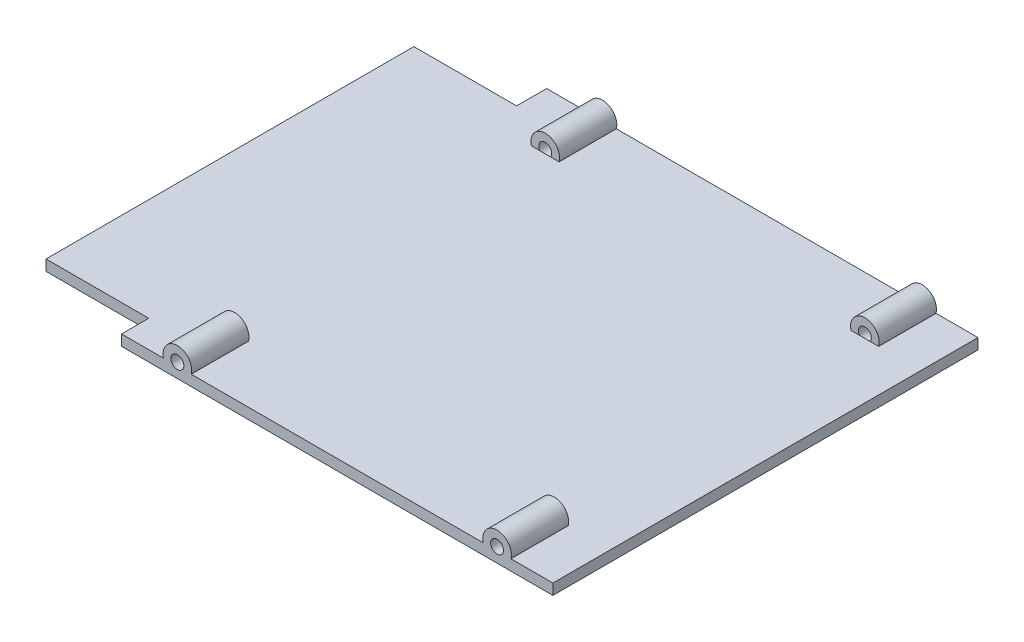
ISO-10303-21;
HEADER;
FILE_DESCRIPTION(('STEP AP214'),'2;1');
FILE_NAME('part.step','',(''),(''),'','','');
FILE_SCHEMA(('AUTOMOTIVE_DESIGN { 1 0 10303 214 1 1 1 1 }'));
ENDSEC;
DATA;
#1=APPLICATION_CONTEXT('core data for automotive mechanical design processes');
#2=APPLICATION_PROTOCOL_DEFINITION('international standard','automotive_design',2000,#1);
#3=PRODUCT_CONTEXT('',#1,'mechanical');
#4=PRODUCT('Part','Part','',(#3));
#5=PRODUCT_RELATED_PRODUCT_CATEGORY('part','',(#4));
#6=PRODUCT_DEFINITION_FORMATION('','',#4);
#7=PRODUCT_DEFINITION_CONTEXT('part definition',#1,'design');
#8=PRODUCT_DEFINITION('design','',#6,#7);
#9=PRODUCT_DEFINITION_SHAPE('','',#8);
#10=(LENGTH_UNIT() NAMED_UNIT(*) SI_UNIT(.MILLI.,.METRE.));
#11=(NAMED_UNIT(*) PLANE_ANGLE_UNIT() SI_UNIT($,.RADIAN.));
#12=(NAMED_UNIT(*) SI_UNIT($,.STERADIAN.) SOLID_ANGLE_UNIT());
#13=UNCERTAINTY_MEASURE_WITH_UNIT(LENGTH_MEASURE(1.E-05),#10,'distance_accuracy_value','');
#14=(GEOMETRIC_REPRESENTATION_CONTEXT(3) GLOBAL_UNCERTAINTY_ASSIGNED_CONTEXT((#13)) GLOBAL_UNIT_ASSIGNED_CONTEXT((#10,
#11,#12)) REPRESENTATION_CONTEXT('',''));
#15=CARTESIAN_POINT('',(0.,0.,0.));
#16=DIRECTION('',(0.,0.,1.));
#17=DIRECTION('',(1.,0.,0.));
#18=AXIS2_PLACEMENT_3D('',#15,#16,#17);
#19=CARTESIAN_POINT('',(-536.173043629544,-6.26719487503217,-135.104672809914));
#20=DIRECTION('',(1.,0.,0.));
#21=DIRECTION('',(0.,0.,-1.));
#22=AXIS2_PLACEMENT_3D('',#19,#20,#21);
#23=PLANE('',#22);
#24=DIRECTION('',(0.,1.,0.));
#25=VECTOR('',#24,1.);
#26=CARTESIAN_POINT('',(-536.173043629546,-26.2671948750322,-19.2560035032262));
#27=LINE('',#26,#25);
#28=CARTESIAN_POINT('',(-536.173043629544,-26.2671948750323,-19.2560035032263));
#29=VERTEX_POINT('',#28);
#30=CARTESIAN_POINT('',(-536.173043629544,-24.7671948750323,-19.2560035032263));
#31=VERTEX_POINT('',#30);
#32=EDGE_CURVE('E467',#29,#31,#27,.T.);
#33=ORIENTED_EDGE('',*,*,#32,.F.);
#34=DIRECTION('',(0.,0.,1.));
#35=VECTOR('',#34,1.);
#36=CARTESIAN_POINT('',(-536.173043629544,-26.2671948750323,-135.104672809914));
#37=LINE('',#36,#35);
#38=CARTESIAN_POINT('',(-536.173043629544,-26.2671948750323,-15.4560035032414));
#39=VERTEX_POINT('',#38);
#40=EDGE_CURVE('E381',#29,#39,#37,.T.);
#41=ORIENTED_EDGE('',*,*,#40,.T.);
#42=DIRECTION('',(0.,1.,0.));
#43=VECTOR('',#42,1.);
#44=CARTESIAN_POINT('',(-536.173043629544,-6.26719487503217,-15.4560035032414));
#45=LINE('',#44,#43);
#46=CARTESIAN_POINT('',(-536.173043629544,-24.7671948750323,-15.4560035032414));
#47=VERTEX_POINT('',#46);
#48=EDGE_CURVE('E370',#39,#47,#45,.T.);
#49=ORIENTED_EDGE('',*,*,#48,.T.);
#50=DIRECTION('',(0.,0.,1.));
#51=VECTOR('',#50,1.);
#52=CARTESIAN_POINT('',(-536.173043629544,-24.7671948750323,-135.104672809914));
#53=LINE('',#52,#51);
#54=EDGE_CURVE('E411',#31,#47,#53,.T.);
#55=ORIENTED_EDGE('',*,*,#54,.F.);
#56=EDGE_LOOP('',(#33,#41,#49,#55));
#57=FACE_BOUND('',#56,.T.);
#58=ADVANCED_FACE('F40',(#57),#23,.F.);
#59=DIRECTION('',(0.,-1.,0.));
#60=VECTOR('',#59,1.);
#61=CARTESIAN_POINT('',(-536.173043629546,-24.7671948750323,-70.6360035032162));
#62=LINE('',#61,#60);
#63=CARTESIAN_POINT('',(-536.173043629544,-24.7671948750323,-70.6360035032162));
#64=VERTEX_POINT('',#63);
#65=CARTESIAN_POINT('',(-536.173043629546,-26.2671948750323,-70.6360035032162));
#66=VERTEX_POINT('',#65);
#67=EDGE_CURVE('E453',#64,#66,#62,.T.);
#68=ORIENTED_EDGE('',*,*,#67,.F.);
#69=CARTESIAN_POINT('',(-536.173043629544,-24.7671948750323,-74.8360035032172));
#70=VERTEX_POINT('',#69);
#71=EDGE_CURVE('E408',#70,#64,#53,.T.);
#72=ORIENTED_EDGE('',*,*,#71,.F.);
#73=DIRECTION('',(0.,1.,0.));
#74=VECTOR('',#73,1.);
#75=CARTESIAN_POINT('',(-536.173043629544,-6.26719487503217,-74.8360035032172));
#76=LINE('',#75,#74);
#77=CARTESIAN_POINT('',(-536.173043629544,-26.2671948750323,-74.8360035032172));
#78=VERTEX_POINT('',#77);
#79=EDGE_CURVE('E375',#78,#70,#76,.T.);
#80=ORIENTED_EDGE('',*,*,#79,.F.);
#81=EDGE_CURVE('E376',#78,#66,#37,.T.);
#82=ORIENTED_EDGE('',*,*,#81,.T.);
#83=EDGE_LOOP('',(#68,#72,#80,#82));
#84=FACE_BOUND('',#83,.T.);
#85=ADVANCED_FACE('F264',(#84),#23,.F.);
#86=CARTESIAN_POINT('',(-360.373043629546,-24.7671948750323,-135.104672809914));
#87=DIRECTION('',(0.,-1.,0.));
#88=DIRECTION('',(0.,0.,-1.));
#89=AXIS2_PLACEMENT_3D('',#86,#87,#88);
#90=PLANE('',#89);
#91=DIRECTION('',(-1.,0.,0.));
#92=VECTOR('',#91,1.);
#93=CARTESIAN_POINT('',(-360.373043629546,-24.7671948750323,-23.4560035032414));
#94=LINE('',#93,#92);
#95=CARTESIAN_POINT('',(-526.43655195634,-24.7671948750323,-23.4560035032414));
#96=VERTEX_POINT('',#95);
#97=CARTESIAN_POINT('',(-527.624712152125,-24.7671948750322,-23.4560035032414));
#98=VERTEX_POINT('',#97);
#99=EDGE_CURVE('E190',#96,#98,#94,.T.);
#100=ORIENTED_EDGE('',*,*,#99,.F.);
#101=DIRECTION('',(0.,0.,1.));
#102=VECTOR('',#101,1.);
#103=CARTESIAN_POINT('',(-526.43655195634,-24.7671948750323,-23.4560035032414));
#104=LINE('',#103,#102);
#105=CARTESIAN_POINT('',(-526.43655195634,-24.7671948750322,-15.4560035032414));
#106=VERTEX_POINT('',#105);
#107=EDGE_CURVE('E212',#96,#106,#104,.T.);
#108=ORIENTED_EDGE('',*,*,#107,.T.);
#109=DIRECTION('',(1.,0.,0.));
#110=VECTOR('',#109,1.);
#111=CARTESIAN_POINT('',(-360.373043629546,-24.7671948750323,-15.4560035032414));
#112=LINE('',#111,#110);
#113=CARTESIAN_POINT('',(-485.659535302359,-24.7671948750323,-15.4560035032414));
#114=VERTEX_POINT('',#113);
#115=EDGE_CURVE('E244',#106,#114,#112,.T.);
#116=ORIENTED_EDGE('',*,*,#115,.T.);
#117=DIRECTION('',(0.,0.,1.));
#118=VECTOR('',#117,1.);
#119=CARTESIAN_POINT('',(-485.659535302359,-24.7671948750323,-23.4560035032414));
#120=LINE('',#119,#118);
#121=CARTESIAN_POINT('',(-485.659535302359,-24.7671948750323,-23.4560035032414));
#122=VERTEX_POINT('',#121);
#123=EDGE_CURVE('E222',#114,#122,#120,.F.);
#124=ORIENTED_EDGE('',*,*,#123,.T.);
#125=DIRECTION('',(-1.,0.,0.));
#126=VECTOR('',#125,1.);
#127=CARTESIAN_POINT('',(-360.373043629546,-24.7671948750323,-23.4560035032414));
#128=LINE('',#127,#126);
#129=CARTESIAN_POINT('',(-484.471375106822,-24.7671948750323,-23.4560035032414));
#130=VERTEX_POINT('',#129);
#131=EDGE_CURVE('E208',#130,#122,#128,.T.);
#132=ORIENTED_EDGE('',*,*,#131,.F.);
#133=CARTESIAN_POINT('',(-482.974712152109,-24.7671948750323,-23.4560035032414));
#134=VERTEX_POINT('',#133);
#135=EDGE_CURVE('E207',#134,#130,#128,.T.);
#136=ORIENTED_EDGE('',*,*,#135,.F.);
#137=CARTESIAN_POINT('',(-481.786551956575,-24.7671948750323,-23.4560035032414));
#138=VERTEX_POINT('',#137);
#139=EDGE_CURVE('E205',#138,#134,#128,.T.);
#140=ORIENTED_EDGE('',*,*,#139,.F.);
#141=DIRECTION('',(0.,0.,1.));
#142=VECTOR('',#141,1.);
#143=CARTESIAN_POINT('',(-481.786551956575,-24.7671948750323,-23.4560035032414));
#144=LINE('',#143,#142);
#145=CARTESIAN_POINT('',(-481.786551956575,-24.7671948750323,-15.4560035032414));
#146=VERTEX_POINT('',#145);
#147=EDGE_CURVE('E217',#138,#146,#144,.T.);
#148=ORIENTED_EDGE('',*,*,#147,.T.);
#149=CARTESIAN_POINT('',(-475.923043629544,-24.7671948750323,-15.4560035032414));
#150=VERTEX_POINT('',#149);
#151=EDGE_CURVE('E394',#146,#150,#112,.T.);
#152=ORIENTED_EDGE('',*,*,#151,.T.);
#153=DIRECTION('',(0.,0.,1.));
#154=VECTOR('',#153,1.);
#155=CARTESIAN_POINT('',(-475.923043629544,-24.7671948750323,-135.104672809914));
#156=LINE('',#155,#154);
#157=CARTESIAN_POINT('',(-475.923043629544,-24.7671948750323,-74.8360035032172));
#158=VERTEX_POINT('',#157);
#159=EDGE_CURVE('E392',#158,#150,#156,.T.);
#160=ORIENTED_EDGE('',*,*,#159,.F.);
#161=DIRECTION('',(1.,0.,0.));
#162=VECTOR('',#161,1.);
#163=CARTESIAN_POINT('',(-360.373043629546,-24.7671948750323,-74.8360035032172));
#164=LINE('',#163,#162);
#165=CARTESIAN_POINT('',(-481.786551955716,-24.7671948750323,-74.8360035032172));
#166=VERTEX_POINT('',#165);
#167=EDGE_CURVE('E379',#166,#158,#164,.T.);
#168=ORIENTED_EDGE('',*,*,#167,.F.);
#169=DIRECTION('',(0.,0.,-1.));
#170=VECTOR('',#169,1.);
#171=CARTESIAN_POINT('',(-481.786551955716,-24.7671948750323,-66.8360035032172));
#172=LINE('',#171,#170);
#173=CARTESIAN_POINT('',(-481.786551955716,-24.7671948750323,-66.8360035032172));
#174=VERTEX_POINT('',#173);
#175=EDGE_CURVE('E430',#166,#174,#172,.F.);
#176=ORIENTED_EDGE('',*,*,#175,.T.);
#177=DIRECTION('',(1.,0.,0.));
#178=VECTOR('',#177,1.);
#179=CARTESIAN_POINT('',(-360.373043629546,-24.7671948750323,-66.8360035032172));
#180=LINE('',#179,#178);
#181=CARTESIAN_POINT('',(-482.974712152113,-24.7671948750323,-66.8360035032172));
#182=VERTEX_POINT('',#181);
#183=EDGE_CURVE('E420',#182,#174,#180,.T.);
#184=ORIENTED_EDGE('',*,*,#183,.F.);
#185=CARTESIAN_POINT('',(-484.471375106822,-24.7671948750323,-66.8360035032172));
#186=VERTEX_POINT('',#185);
#187=EDGE_CURVE('E427',#186,#182,#180,.T.);
#188=ORIENTED_EDGE('',*,*,#187,.F.);
#189=CARTESIAN_POINT('',(-485.659535303219,-24.7671948750323,-66.8360035032172));
#190=VERTEX_POINT('',#189);
#191=EDGE_CURVE('E423',#190,#186,#180,.T.);
#192=ORIENTED_EDGE('',*,*,#191,.F.);
#193=DIRECTION('',(0.,0.,-1.));
#194=VECTOR('',#193,1.);
#195=CARTESIAN_POINT('',(-485.659535303219,-24.7671948750323,-66.8360035032172));
#196=LINE('',#195,#194);
#197=CARTESIAN_POINT('',(-485.659535303219,-24.7671948750323,-74.8360035032172));
#198=VERTEX_POINT('',#197);
#199=EDGE_CURVE('E528',#190,#198,#196,.T.);
#200=ORIENTED_EDGE('',*,*,#199,.T.);
#201=CARTESIAN_POINT('',(-526.436551956938,-24.7671948750323,-74.8360035032172));
#202=VERTEX_POINT('',#201);
#203=EDGE_CURVE('E403',#202,#198,#164,.T.);
#204=ORIENTED_EDGE('',*,*,#203,.F.);
#205=DIRECTION('',(0.,0.,-1.));
#206=VECTOR('',#205,1.);
#207=CARTESIAN_POINT('',(-526.436551956938,-24.7671948750323,-66.8360035032172));
#208=LINE('',#207,#206);
#209=CARTESIAN_POINT('',(-526.436551956938,-24.7671948750323,-66.8360035032172));
#210=VERTEX_POINT('',#209);
#211=EDGE_CURVE('E434',#202,#210,#208,.F.);
#212=ORIENTED_EDGE('',*,*,#211,.T.);
#213=DIRECTION('',(1.,0.,0.));
#214=VECTOR('',#213,1.);
#215=CARTESIAN_POINT('',(-360.373043629546,-24.7671948750323,-66.8360035032172));
#216=LINE('',#215,#214);
#217=CARTESIAN_POINT('',(-527.624712152128,-24.7671948750323,-66.8360035032172));
#218=VERTEX_POINT('',#217);
#219=EDGE_CURVE('E437',#218,#210,#216,.T.);
#220=ORIENTED_EDGE('',*,*,#219,.F.);
#221=CARTESIAN_POINT('',(-529.121375106838,-24.7671948750323,-66.8360035032172));
#222=VERTEX_POINT('',#221);
#223=EDGE_CURVE('E438',#222,#218,#216,.T.);
#224=ORIENTED_EDGE('',*,*,#223,.F.);
#225=CARTESIAN_POINT('',(-530.309535302028,-24.7671948750323,-66.8360035032172));
#226=VERTEX_POINT('',#225);
#227=EDGE_CURVE('E439',#226,#222,#216,.T.);
#228=ORIENTED_EDGE('',*,*,#227,.F.);
#229=DIRECTION('',(0.,0.,-1.));
#230=VECTOR('',#229,1.);
#231=CARTESIAN_POINT('',(-530.309535302028,-24.7671948750323,-66.8360035032172));
#232=LINE('',#231,#230);
#233=CARTESIAN_POINT('',(-530.309535302028,-24.7671948750323,-74.8360035032172));
#234=VERTEX_POINT('',#233);
#235=EDGE_CURVE('E431',#226,#234,#232,.T.);
#236=ORIENTED_EDGE('',*,*,#235,.T.);
#237=EDGE_CURVE('E401',#70,#234,#164,.T.);
#238=ORIENTED_EDGE('',*,*,#237,.F.);
#239=ORIENTED_EDGE('',*,*,#71,.T.);
#240=DIRECTION('',(1.,0.,0.));
#241=VECTOR('',#240,1.);
#242=CARTESIAN_POINT('',(-602.124934645333,-24.7671948750274,-70.6360035032162));
#243=LINE('',#242,#241);
#244=CARTESIAN_POINT('',(-550.523043629545,-24.7671948750312,-70.6360035032162));
#245=VERTEX_POINT('',#244);
#246=EDGE_CURVE('E449',#245,#64,#243,.T.);
#247=ORIENTED_EDGE('',*,*,#246,.F.);
#248=DIRECTION('',(0.,0.,-1.));
#249=VECTOR('',#248,1.);
#250=CARTESIAN_POINT('',(-550.523043629545,-24.7671948750312,-19.2560035032262));
#251=LINE('',#250,#249);
#252=CARTESIAN_POINT('',(-550.523043629545,-24.7671948750274,-19.2560035032262));
#253=VERTEX_POINT('',#252);
#254=EDGE_CURVE('E471',#253,#245,#251,.T.);
#255=ORIENTED_EDGE('',*,*,#254,.F.);
#256=DIRECTION('',(1.,0.,0.));
#257=VECTOR('',#256,1.);
#258=CARTESIAN_POINT('',(-602.124934645333,-24.7671948750274,-19.2560035032262));
#259=LINE('',#258,#257);
#260=EDGE_CURVE('E385',#253,#31,#259,.T.);
#261=ORIENTED_EDGE('',*,*,#260,.T.);
#262=ORIENTED_EDGE('',*,*,#54,.T.);
#263=CARTESIAN_POINT('',(-530.309535302623,-24.7671948750323,-15.4560035032414));
#264=VERTEX_POINT('',#263);
#265=EDGE_CURVE('E373',#47,#264,#112,.T.);
#266=ORIENTED_EDGE('',*,*,#265,.T.);
#267=DIRECTION('',(0.,0.,1.));
#268=VECTOR('',#267,1.);
#269=CARTESIAN_POINT('',(-530.309535302623,-24.7671948750323,-23.4560035032414));
#270=LINE('',#269,#268);
#271=CARTESIAN_POINT('',(-530.309535302623,-24.7671948750323,-23.4560035032414));
#272=VERTEX_POINT('',#271);
#273=EDGE_CURVE('E215',#264,#272,#270,.F.);
#274=ORIENTED_EDGE('',*,*,#273,.T.);
#275=CARTESIAN_POINT('',(-529.121375106838,-24.7671948750323,-23.4560035032414));
#276=VERTEX_POINT('',#275);
#277=EDGE_CURVE('E193',#276,#272,#94,.T.);
#278=ORIENTED_EDGE('',*,*,#277,.F.);
#279=EDGE_CURVE('E184',#98,#276,#94,.T.);
#280=ORIENTED_EDGE('',*,*,#279,.F.);
#281=EDGE_LOOP('',(#100,#108,#116,#124,#132,#136,#140,#148,#152,#160,#168,#176,#184,#188,#192,
#200,#204,#212,#220,#224,#228,#236,#238,#239,#247,#255,#261,#262,#266,#274,#278,#280));
#282=FACE_BOUND('',#281,.T.);
#283=ADVANCED_FACE('F188',(#282),#90,.F.);
#284=CARTESIAN_POINT('',(-475.923043629544,-6.26719487503217,-135.104672809914));
#285=DIRECTION('',(-1.,0.,0.));
#286=DIRECTION('',(0.,0.,1.));
#287=AXIS2_PLACEMENT_3D('',#284,#285,#286);
#288=PLANE('',#287);
#289=DIRECTION('',(0.,-1.,0.));
#290=VECTOR('',#289,1.);
#291=CARTESIAN_POINT('',(-475.923043629544,-6.26719487503217,-74.8360035032172));
#292=LINE('',#291,#290);
#293=CARTESIAN_POINT('',(-475.923043629544,-26.2671948750323,-74.8360035032172));
#294=VERTEX_POINT('',#293);
#295=EDGE_CURVE('E398',#158,#294,#292,.T.);
#296=ORIENTED_EDGE('',*,*,#295,.F.);
#297=ORIENTED_EDGE('',*,*,#159,.T.);
#298=DIRECTION('',(0.,-1.,0.));
#299=VECTOR('',#298,1.);
#300=CARTESIAN_POINT('',(-475.923043629544,-6.26719487503217,-15.4560035032414));
#301=LINE('',#300,#299);
#302=CARTESIAN_POINT('',(-475.923043629544,-26.2671948750323,-15.4560035032414));
#303=VERTEX_POINT('',#302);
#304=EDGE_CURVE('E389',#150,#303,#301,.T.);
#305=ORIENTED_EDGE('',*,*,#304,.T.);
#306=DIRECTION('',(0.,0.,1.));
#307=VECTOR('',#306,1.);
#308=CARTESIAN_POINT('',(-475.923043629544,-26.2671948750323,-135.104672809914));
#309=LINE('',#308,#307);
#310=EDGE_CURVE('E388',#294,#303,#309,.T.);
#311=ORIENTED_EDGE('',*,*,#310,.F.);
#312=EDGE_LOOP('',(#296,#297,#305,#311));
#313=FACE_BOUND('',#312,.T.);
#314=ADVANCED_FACE('F279',(#313),#288,.F.);
#315=CARTESIAN_POINT('',(-360.373043629546,-26.2671948750322,-135.104672809914));
#316=DIRECTION('',(0.,1.,0.));
#317=DIRECTION('',(-1.,0.,0.));
#318=AXIS2_PLACEMENT_3D('',#315,#316,#317);
#319=PLANE('',#318);
#320=DIRECTION('',(-1.,0.,0.));
#321=VECTOR('',#320,1.);
#322=CARTESIAN_POINT('',(-360.373043629546,-26.2671948750322,-15.4560035032414));
#323=LINE('',#322,#321);
#324=EDGE_CURVE('E372',#303,#39,#323,.T.);
#325=ORIENTED_EDGE('',*,*,#324,.T.);
#326=ORIENTED_EDGE('',*,*,#40,.F.);
#327=DIRECTION('',(1.,0.,0.));
#328=VECTOR('',#327,1.);
#329=CARTESIAN_POINT('',(-602.124934645333,-26.2671948750274,-19.2560035032262));
#330=LINE('',#329,#328);
#331=CARTESIAN_POINT('',(-550.523043629545,-26.2671948750312,-19.2560035032262));
#332=VERTEX_POINT('',#331);
#333=EDGE_CURVE('E465',#332,#29,#330,.T.);
#334=ORIENTED_EDGE('',*,*,#333,.F.);
#335=DIRECTION('',(0.,0.,1.));
#336=VECTOR('',#335,1.);
#337=CARTESIAN_POINT('',(-550.523043629545,-26.2671948750312,-70.6360035032162));
#338=LINE('',#337,#336);
#339=CARTESIAN_POINT('',(-550.523043629545,-26.2671948750312,-70.6360035032162));
#340=VERTEX_POINT('',#339);
#341=EDGE_CURVE('E473',#340,#332,#338,.T.);
#342=ORIENTED_EDGE('',*,*,#341,.F.);
#343=DIRECTION('',(1.,0.,0.));
#344=VECTOR('',#343,1.);
#345=CARTESIAN_POINT('',(-602.124934645333,-26.2671948750274,-70.6360035032162));
#346=LINE('',#345,#344);
#347=EDGE_CURVE('E458',#340,#66,#346,.T.);
#348=ORIENTED_EDGE('',*,*,#347,.T.);
#349=ORIENTED_EDGE('',*,*,#81,.F.);
#350=DIRECTION('',(-1.,0.,0.));
#351=VECTOR('',#350,1.);
#352=CARTESIAN_POINT('',(-360.373043629546,-26.2671948750322,-74.8360035032172));
#353=LINE('',#352,#351);
#354=EDGE_CURVE('E395',#294,#78,#353,.T.);
#355=ORIENTED_EDGE('',*,*,#354,.F.);
#356=ORIENTED_EDGE('',*,*,#310,.T.);
#357=EDGE_LOOP('',(#325,#326,#334,#342,#348,#349,#355,#356));
#358=FACE_BOUND('',#357,.T.);
#359=ADVANCED_FACE('F276',(#358),#319,.F.);
#360=CARTESIAN_POINT('',(0.,0.,-15.4560035032414));
#361=DIRECTION('',(0.,0.,-1.));
#362=DIRECTION('',(0.,1.,0.));
#363=AXIS2_PLACEMENT_3D('',#360,#361,#362);
#364=PLANE('',#363);
#365=CARTESIAN_POINT('',(-483.723043629466,-24.267194875035,-15.4560035032414));
#366=DIRECTION('',(0.,0.,1.));
#367=DIRECTION('',(1.,0.,0.));
#368=AXIS2_PLACEMENT_3D('',#365,#366,#367);
#369=CIRCLE('',#368,0.900000000000005);
#370=CARTESIAN_POINT('',(-482.823043629466,-24.267194875035,-15.4560035032414));
#371=VERTEX_POINT('',#370);
#372=EDGE_CURVE('E236',#371,#371,#369,.T.);
#373=ORIENTED_EDGE('',*,*,#372,.F.);
#374=EDGE_LOOP('',(#373));
#375=FACE_BOUND('',#374,.T.);
#376=CARTESIAN_POINT('',(-528.373043629481,-24.267194875035,-15.4560035032414));
#377=DIRECTION('',(0.,0.,1.));
#378=DIRECTION('',(1.,0.,0.));
#379=AXIS2_PLACEMENT_3D('',#376,#377,#378);
#380=CIRCLE('',#379,0.900000000000005);
#381=CARTESIAN_POINT('',(-527.473043629481,-24.267194875035,-15.4560035032414));
#382=VERTEX_POINT('',#381);
#383=EDGE_CURVE('E185',#382,#382,#380,.T.);
#384=ORIENTED_EDGE('',*,*,#383,.F.);
#385=EDGE_LOOP('',(#384));
#386=FACE_BOUND('',#385,.T.);
#387=ORIENTED_EDGE('',*,*,#48,.F.);
#388=ORIENTED_EDGE('',*,*,#324,.F.);
#389=ORIENTED_EDGE('',*,*,#304,.F.);
#390=ORIENTED_EDGE('',*,*,#151,.F.);
#391=CARTESIAN_POINT('',(-483.723043629467,-24.2671948750323,-15.4560035032414));
#392=DIRECTION('',(0.,0.,1.));
#393=DIRECTION('',(1.,0.,0.));
#394=AXIS2_PLACEMENT_3D('',#391,#392,#393);
#395=CIRCLE('',#394,1.99999999979497);
#396=EDGE_CURVE('E227',#146,#114,#395,.T.);
#397=ORIENTED_EDGE('',*,*,#396,.T.);
#398=ORIENTED_EDGE('',*,*,#115,.F.);
#399=CARTESIAN_POINT('',(-528.373043629481,-24.267194875035,-15.4560035032414));
#400=DIRECTION('',(0.,0.,1.));
#401=DIRECTION('',(1.,0.,0.));
#402=AXIS2_PLACEMENT_3D('',#399,#400,#401);
#403=CIRCLE('',#402,2.00000000003575);
#404=EDGE_CURVE('E230',#106,#264,#403,.T.);
#405=ORIENTED_EDGE('',*,*,#404,.T.);
#406=ORIENTED_EDGE('',*,*,#265,.F.);
#407=EDGE_LOOP('',(#387,#388,#389,#390,#397,#398,#405,#406));
#408=FACE_BOUND('',#407,.T.);
#409=ADVANCED_FACE('F274',(#375,#386,#408),#364,.F.);
#410=CARTESIAN_POINT('',(-360.373043629544,-6.26719487503481,-74.8360035032172));
#411=DIRECTION('',(0.,0.,-1.));
#412=DIRECTION('',(-1.,0.,0.));
#413=AXIS2_PLACEMENT_3D('',#410,#411,#412);
#414=PLANE('',#413);
#415=CARTESIAN_POINT('',(-528.373043629483,-24.2671948750323,-74.8360035032172));
#416=DIRECTION('',(0.,0.,-1.));
#417=DIRECTION('',(0.,1.,0.));
#418=AXIS2_PLACEMENT_3D('',#415,#416,#417);
#419=CIRCLE('',#418,0.900000000000005);
#420=CARTESIAN_POINT('',(-528.373043629483,-23.3671948750323,-74.8360035032172));
#421=VERTEX_POINT('',#420);
#422=EDGE_CURVE('E543',#421,#421,#419,.T.);
#423=ORIENTED_EDGE('',*,*,#422,.F.);
#424=EDGE_LOOP('',(#423));
#425=FACE_BOUND('',#424,.T.);
#426=CARTESIAN_POINT('',(-483.723043629467,-24.2671948750323,-74.8360035032172));
#427=DIRECTION('',(0.,0.,-1.));
#428=DIRECTION('',(0.,1.,0.));
#429=AXIS2_PLACEMENT_3D('',#426,#427,#428);
#430=CIRCLE('',#429,0.900000000000005);
#431=CARTESIAN_POINT('',(-483.723043629467,-23.3671948750323,-74.8360035032172));
#432=VERTEX_POINT('',#431);
#433=EDGE_CURVE('E201',#432,#432,#430,.T.);
#434=ORIENTED_EDGE('',*,*,#433,.F.);
#435=EDGE_LOOP('',(#434));
#436=FACE_BOUND('',#435,.T.);
#437=ORIENTED_EDGE('',*,*,#237,.T.);
#438=CARTESIAN_POINT('',(-528.373043629483,-24.2671948750323,-74.8360035032172));
#439=DIRECTION('',(0.,0.,-1.));
#440=DIRECTION('',(0.,1.,0.));
#441=AXIS2_PLACEMENT_3D('',#438,#439,#440);
#442=CIRCLE('',#441,1.99999999945899);
#443=EDGE_CURVE('E538',#234,#202,#442,.T.);
#444=ORIENTED_EDGE('',*,*,#443,.T.);
#445=ORIENTED_EDGE('',*,*,#203,.T.);
#446=CARTESIAN_POINT('',(-483.723043629467,-24.2671948750323,-74.8360035032172));
#447=DIRECTION('',(0.,0.,-1.));
#448=DIRECTION('',(0.,1.,0.));
#449=AXIS2_PLACEMENT_3D('',#446,#447,#448);
#450=CIRCLE('',#449,2.00000000062726);
#451=EDGE_CURVE('E536',#198,#166,#450,.T.);
#452=ORIENTED_EDGE('',*,*,#451,.T.);
#453=ORIENTED_EDGE('',*,*,#167,.T.);
#454=ORIENTED_EDGE('',*,*,#295,.T.);
#455=ORIENTED_EDGE('',*,*,#354,.T.);
#456=ORIENTED_EDGE('',*,*,#79,.T.);
#457=EDGE_LOOP('',(#437,#444,#445,#452,#453,#454,#455,#456));
#458=FACE_BOUND('',#457,.T.);
#459=ADVANCED_FACE('F42',(#425,#436,#458),#414,.T.);
#460=CARTESIAN_POINT('',(-602.124934645333,-24.7671948750274,-70.6360035032162));
#461=DIRECTION('',(0.,0.,1.));
#462=DIRECTION('',(1.,0.,0.));
#463=AXIS2_PLACEMENT_3D('',#460,#461,#462);
#464=PLANE('',#463);
#465=DIRECTION('',(0.,-1.,0.));
#466=VECTOR('',#465,1.);
#467=CARTESIAN_POINT('',(-550.523043629545,-24.7671948750274,-70.6360035032162));
#468=LINE('',#467,#466);
#469=EDGE_CURVE('E476',#245,#340,#468,.T.);
#470=ORIENTED_EDGE('',*,*,#469,.F.);
#471=ORIENTED_EDGE('',*,*,#246,.T.);
#472=ORIENTED_EDGE('',*,*,#67,.T.);
#473=ORIENTED_EDGE('',*,*,#347,.F.);
#474=EDGE_LOOP('',(#470,#471,#472,#473));
#475=FACE_BOUND('',#474,.T.);
#476=ADVANCED_FACE('F485',(#475),#464,.F.);
#477=CARTESIAN_POINT('',(-602.124934645333,-26.2671948750274,-19.2560035032262));
#478=DIRECTION('',(0.,0.,-1.));
#479=DIRECTION('',(-1.,0.,0.));
#480=AXIS2_PLACEMENT_3D('',#477,#478,#479);
#481=PLANE('',#480);
#482=DIRECTION('',(0.,1.,0.));
#483=VECTOR('',#482,1.);
#484=CARTESIAN_POINT('',(-550.523043629545,-26.2671948750274,-19.2560035032262));
#485=LINE('',#484,#483);
#486=EDGE_CURVE('E462',#332,#253,#485,.T.);
#487=ORIENTED_EDGE('',*,*,#486,.F.);
#488=ORIENTED_EDGE('',*,*,#333,.T.);
#489=ORIENTED_EDGE('',*,*,#32,.T.);
#490=ORIENTED_EDGE('',*,*,#260,.F.);
#491=EDGE_LOOP('',(#487,#488,#489,#490));
#492=FACE_BOUND('',#491,.T.);
#493=ADVANCED_FACE('F487',(#492),#481,.F.);
#494=CARTESIAN_POINT('',(-550.523043629545,-23.2671948750155,1.38331061583378));
#495=DIRECTION('',(-1.,0.,0.));
#496=DIRECTION('',(0.,0.,1.));
#497=AXIS2_PLACEMENT_3D('',#494,#495,#496);
#498=PLANE('',#497);
#499=ORIENTED_EDGE('',*,*,#486,.T.);
#500=ORIENTED_EDGE('',*,*,#254,.T.);
#501=ORIENTED_EDGE('',*,*,#469,.T.);
#502=ORIENTED_EDGE('',*,*,#341,.T.);
#503=EDGE_LOOP('',(#499,#500,#501,#502));
#504=FACE_BOUND('',#503,.T.);
#505=ADVANCED_FACE('F480',(#504),#498,.T.);
#506=CARTESIAN_POINT('',(-483.723043629467,-24.2671948750323,-66.8360035032172));
#507=DIRECTION('',(0.,0.,-1.));
#508=DIRECTION('',(0.,1.,0.));
#509=AXIS2_PLACEMENT_3D('',#506,#507,#508);
#510=PLANE('',#509);
#511=ORIENTED_EDGE('',*,*,#191,.T.);
#512=CARTESIAN_POINT('',(-483.723043629467,-24.2671948750323,-66.8360035032172));
#513=DIRECTION('',(0.,0.,-1.));
#514=DIRECTION('',(0.,1.,0.));
#515=AXIS2_PLACEMENT_3D('',#512,#513,#514);
#516=CIRCLE('',#515,0.900000000000005);
#517=EDGE_CURVE('E180',#186,#182,#516,.T.);
#518=ORIENTED_EDGE('',*,*,#517,.T.);
#519=ORIENTED_EDGE('',*,*,#183,.T.);
#520=CARTESIAN_POINT('',(-483.723043629467,-24.2671948750323,-66.8360035032172));
#521=DIRECTION('',(0.,0.,-1.));
#522=DIRECTION('',(0.,1.,0.));
#523=AXIS2_PLACEMENT_3D('',#520,#521,#522);
#524=CIRCLE('',#523,2.00000000062726);
#525=EDGE_CURVE('E534',#190,#174,#524,.T.);
#526=ORIENTED_EDGE('',*,*,#525,.F.);
#527=EDGE_LOOP('',(#511,#518,#519,#526));
#528=FACE_BOUND('',#527,.T.);
#529=ADVANCED_FACE('F418',(#528),#510,.F.);
#530=CARTESIAN_POINT('',(-483.723043629467,-24.2671948750323,-66.8360035032172));
#531=DIRECTION('',(0.,0.,-1.));
#532=DIRECTION('',(0.,1.,0.));
#533=AXIS2_PLACEMENT_3D('',#530,#531,#532);
#534=CYLINDRICAL_SURFACE('',#533,2.00000000062726);
#535=ORIENTED_EDGE('',*,*,#199,.F.);
#536=ORIENTED_EDGE('',*,*,#525,.T.);
#537=ORIENTED_EDGE('',*,*,#175,.F.);
#538=ORIENTED_EDGE('',*,*,#451,.F.);
#539=EDGE_LOOP('',(#535,#536,#537,#538));
#540=FACE_BOUND('',#539,.T.);
#541=ADVANCED_FACE('F498',(#540),#534,.T.);
#542=CARTESIAN_POINT('',(-528.373043629483,-24.2671948750323,-66.8360035032172));
#543=DIRECTION('',(0.,0.,-1.));
#544=DIRECTION('',(0.,1.,0.));
#545=AXIS2_PLACEMENT_3D('',#542,#543,#544);
#546=PLANE('',#545);
#547=ORIENTED_EDGE('',*,*,#227,.T.);
#548=CARTESIAN_POINT('',(-528.373043629483,-24.2671948750323,-66.8360035032172));
#549=DIRECTION('',(0.,0.,-1.));
#550=DIRECTION('',(0.,1.,0.));
#551=AXIS2_PLACEMENT_3D('',#548,#549,#550);
#552=CIRCLE('',#551,0.900000000000005);
#553=EDGE_CURVE('E397',#222,#218,#552,.T.);
#554=ORIENTED_EDGE('',*,*,#553,.T.);
#555=ORIENTED_EDGE('',*,*,#219,.T.);
#556=CARTESIAN_POINT('',(-528.373043629483,-24.2671948750323,-66.8360035032172));
#557=DIRECTION('',(0.,0.,-1.));
#558=DIRECTION('',(0.,1.,0.));
#559=AXIS2_PLACEMENT_3D('',#556,#557,#558);
#560=CIRCLE('',#559,1.99999999945899);
#561=EDGE_CURVE('E533',#226,#210,#560,.T.);
#562=ORIENTED_EDGE('',*,*,#561,.F.);
#563=EDGE_LOOP('',(#547,#554,#555,#562));
#564=FACE_BOUND('',#563,.T.);
#565=ADVANCED_FACE('F501',(#564),#546,.F.);
#566=CARTESIAN_POINT('',(-528.373043629483,-24.2671948750323,-66.8360035032172));
#567=DIRECTION('',(0.,0.,-1.));
#568=DIRECTION('',(0.,1.,0.));
#569=AXIS2_PLACEMENT_3D('',#566,#567,#568);
#570=CYLINDRICAL_SURFACE('',#569,1.99999999945899);
#571=ORIENTED_EDGE('',*,*,#235,.F.);
#572=ORIENTED_EDGE('',*,*,#561,.T.);
#573=ORIENTED_EDGE('',*,*,#211,.F.);
#574=ORIENTED_EDGE('',*,*,#443,.F.);
#575=EDGE_LOOP('',(#571,#572,#573,#574));
#576=FACE_BOUND('',#575,.T.);
#577=ADVANCED_FACE('F503',(#576),#570,.T.);
#578=CARTESIAN_POINT('',(-528.373043629483,-24.2671948750323,-66.8360035032172));
#579=DIRECTION('',(0.,0.,-1.));
#580=DIRECTION('',(0.,1.,0.));
#581=AXIS2_PLACEMENT_3D('',#578,#579,#580);
#582=PLANE('',#581);
#583=ORIENTED_EDGE('',*,*,#223,.T.);
#584=CARTESIAN_POINT('',(-528.373043629483,-24.2671948750323,-66.8360035032172));
#585=DIRECTION('',(0.,0.,-1.));
#586=DIRECTION('',(0.,1.,0.));
#587=AXIS2_PLACEMENT_3D('',#584,#585,#586);
#588=CIRCLE('',#587,0.900000000000005);
#589=EDGE_CURVE('E522',#218,#222,#588,.T.);
#590=ORIENTED_EDGE('',*,*,#589,.T.);
#591=EDGE_LOOP('',(#583,#590));
#592=FACE_BOUND('',#591,.T.);
#593=ADVANCED_FACE('F506',(#592),#582,.T.);
#594=CARTESIAN_POINT('',(-528.373043629483,-24.2671948750323,-66.8360035032172));
#595=DIRECTION('',(0.,0.,-1.));
#596=DIRECTION('',(0.,1.,0.));
#597=AXIS2_PLACEMENT_3D('',#594,#595,#596);
#598=CYLINDRICAL_SURFACE('',#597,0.900000000000005);
#599=ORIENTED_EDGE('',*,*,#589,.F.);
#600=ORIENTED_EDGE('',*,*,#553,.F.);
#601=EDGE_LOOP('',(#599,#600));
#602=FACE_BOUND('',#601,.T.);
#603=ORIENTED_EDGE('',*,*,#422,.T.);
#604=EDGE_LOOP('',(#603));
#605=FACE_BOUND('',#604,.T.);
#606=ADVANCED_FACE('F511',(#602,#605),#598,.F.);
#607=CARTESIAN_POINT('',(-483.723043629467,-24.2671948750323,-66.8360035032172));
#608=DIRECTION('',(0.,0.,-1.));
#609=DIRECTION('',(0.,1.,0.));
#610=AXIS2_PLACEMENT_3D('',#607,#608,#609);
#611=PLANE('',#610);
#612=ORIENTED_EDGE('',*,*,#187,.T.);
#613=CARTESIAN_POINT('',(-483.723043629467,-24.2671948750323,-66.8360035032172));
#614=DIRECTION('',(0.,0.,-1.));
#615=DIRECTION('',(0.,1.,0.));
#616=AXIS2_PLACEMENT_3D('',#613,#614,#615);
#617=CIRCLE('',#616,0.900000000000005);
#618=EDGE_CURVE('E199',#182,#186,#617,.T.);
#619=ORIENTED_EDGE('',*,*,#618,.T.);
#620=EDGE_LOOP('',(#612,#619));
#621=FACE_BOUND('',#620,.T.);
#622=ADVANCED_FACE('F259',(#621),#611,.T.);
#623=CARTESIAN_POINT('',(-483.723043629467,-24.2671948750323,-66.8360035032172));
#624=DIRECTION('',(0.,0.,-1.));
#625=DIRECTION('',(0.,1.,0.));
#626=AXIS2_PLACEMENT_3D('',#623,#624,#625);
#627=CYLINDRICAL_SURFACE('',#626,0.900000000000005);
#628=ORIENTED_EDGE('',*,*,#618,.F.);
#629=ORIENTED_EDGE('',*,*,#517,.F.);
#630=EDGE_LOOP('',(#628,#629));
#631=FACE_BOUND('',#630,.T.);
#632=ORIENTED_EDGE('',*,*,#433,.T.);
#633=EDGE_LOOP('',(#632));
#634=FACE_BOUND('',#633,.T.);
#635=ADVANCED_FACE('F250',(#631,#634),#627,.F.);
#636=CARTESIAN_POINT('',(-483.723043629467,-24.2671948750323,-23.4560035032414));
#637=DIRECTION('',(0.,0.,1.));
#638=DIRECTION('',(1.,0.,0.));
#639=AXIS2_PLACEMENT_3D('',#636,#637,#638);
#640=PLANE('',#639);
#641=ORIENTED_EDGE('',*,*,#139,.T.);
#642=CARTESIAN_POINT('',(-483.723043629466,-24.267194875035,-23.4560035032414));
#643=DIRECTION('',(0.,0.,1.));
#644=DIRECTION('',(1.,0.,0.));
#645=AXIS2_PLACEMENT_3D('',#642,#643,#644);
#646=CIRCLE('',#645,0.900000000000005);
#647=EDGE_CURVE('E12',#134,#130,#646,.T.);
#648=ORIENTED_EDGE('',*,*,#647,.T.);
#649=ORIENTED_EDGE('',*,*,#131,.T.);
#650=CARTESIAN_POINT('',(-483.723043629467,-24.2671948750323,-23.4560035032414));
#651=DIRECTION('',(0.,0.,1.));
#652=DIRECTION('',(1.,0.,0.));
#653=AXIS2_PLACEMENT_3D('',#650,#651,#652);
#654=CIRCLE('',#653,1.99999999979497);
#655=EDGE_CURVE('E224',#138,#122,#654,.T.);
#656=ORIENTED_EDGE('',*,*,#655,.F.);
#657=EDGE_LOOP('',(#641,#648,#649,#656));
#658=FACE_BOUND('',#657,.T.);
#659=ADVANCED_FACE('F248',(#658),#640,.F.);
#660=CARTESIAN_POINT('',(-483.723043629467,-24.2671948750323,-23.4560035032414));
#661=DIRECTION('',(0.,0.,1.));
#662=DIRECTION('',(1.,0.,0.));
#663=AXIS2_PLACEMENT_3D('',#660,#661,#662);
#664=CYLINDRICAL_SURFACE('',#663,1.99999999979497);
#665=ORIENTED_EDGE('',*,*,#147,.F.);
#666=ORIENTED_EDGE('',*,*,#655,.T.);
#667=ORIENTED_EDGE('',*,*,#123,.F.);
#668=ORIENTED_EDGE('',*,*,#396,.F.);
#669=EDGE_LOOP('',(#665,#666,#667,#668));
#670=FACE_BOUND('',#669,.T.);
#671=ADVANCED_FACE('F247',(#670),#664,.T.);
#672=CARTESIAN_POINT('',(-528.373043629481,-24.267194875035,-23.4560035032414));
#673=DIRECTION('',(0.,0.,1.));
#674=DIRECTION('',(1.,0.,0.));
#675=AXIS2_PLACEMENT_3D('',#672,#673,#674);
#676=PLANE('',#675);
#677=ORIENTED_EDGE('',*,*,#99,.T.);
#678=CARTESIAN_POINT('',(-528.373043629481,-24.267194875035,-23.4560035032414));
#679=DIRECTION('',(0.,0.,1.));
#680=DIRECTION('',(1.,0.,0.));
#681=AXIS2_PLACEMENT_3D('',#678,#679,#680);
#682=CIRCLE('',#681,0.900000000000005);
#683=EDGE_CURVE('E48',#98,#276,#682,.T.);
#684=ORIENTED_EDGE('',*,*,#683,.T.);
#685=ORIENTED_EDGE('',*,*,#277,.T.);
#686=CARTESIAN_POINT('',(-528.373043629481,-24.267194875035,-23.4560035032414));
#687=DIRECTION('',(0.,0.,1.));
#688=DIRECTION('',(1.,0.,0.));
#689=AXIS2_PLACEMENT_3D('',#686,#687,#688);
#690=CIRCLE('',#689,2.00000000003575);
#691=EDGE_CURVE('E198',#96,#272,#690,.T.);
#692=ORIENTED_EDGE('',*,*,#691,.F.);
#693=EDGE_LOOP('',(#677,#684,#685,#692));
#694=FACE_BOUND('',#693,.T.);
#695=ADVANCED_FACE('F196',(#694),#676,.F.);
#696=CARTESIAN_POINT('',(-528.373043629481,-24.267194875035,-23.4560035032414));
#697=DIRECTION('',(0.,0.,1.));
#698=DIRECTION('',(1.,0.,0.));
#699=AXIS2_PLACEMENT_3D('',#696,#697,#698);
#700=CYLINDRICAL_SURFACE('',#699,2.00000000003575);
#701=ORIENTED_EDGE('',*,*,#107,.F.);
#702=ORIENTED_EDGE('',*,*,#691,.T.);
#703=ORIENTED_EDGE('',*,*,#273,.F.);
#704=ORIENTED_EDGE('',*,*,#404,.F.);
#705=EDGE_LOOP('',(#701,#702,#703,#704));
#706=FACE_BOUND('',#705,.T.);
#707=ADVANCED_FACE('F291',(#706),#700,.T.);
#708=CARTESIAN_POINT('',(-528.373043629481,-24.267194875035,-23.4560035032414));
#709=DIRECTION('',(0.,0.,1.));
#710=DIRECTION('',(1.,0.,0.));
#711=AXIS2_PLACEMENT_3D('',#708,#709,#710);
#712=PLANE('',#711);
#713=ORIENTED_EDGE('',*,*,#279,.T.);
#714=CARTESIAN_POINT('',(-528.373043629481,-24.267194875035,-23.4560035032414));
#715=DIRECTION('',(0.,0.,1.));
#716=DIRECTION('',(1.,0.,0.));
#717=AXIS2_PLACEMENT_3D('',#714,#715,#716);
#718=CIRCLE('',#717,0.900000000000005);
#719=EDGE_CURVE('E61',#276,#98,#718,.T.);
#720=ORIENTED_EDGE('',*,*,#719,.T.);
#721=EDGE_LOOP('',(#713,#720));
#722=FACE_BOUND('',#721,.T.);
#723=ADVANCED_FACE('F183',(#722),#712,.T.);
#724=CARTESIAN_POINT('',(-528.373043629481,-24.267194875035,-23.4560035032414));
#725=DIRECTION('',(0.,0.,1.));
#726=DIRECTION('',(1.,0.,0.));
#727=AXIS2_PLACEMENT_3D('',#724,#725,#726);
#728=CYLINDRICAL_SURFACE('',#727,0.900000000000005);
#729=ORIENTED_EDGE('',*,*,#719,.F.);
#730=ORIENTED_EDGE('',*,*,#683,.F.);
#731=EDGE_LOOP('',(#729,#730));
#732=FACE_BOUND('',#731,.T.);
#733=ORIENTED_EDGE('',*,*,#383,.T.);
#734=EDGE_LOOP('',(#733));
#735=FACE_BOUND('',#734,.T.);
#736=ADVANCED_FACE('F175',(#732,#735),#728,.F.);
#737=CARTESIAN_POINT('',(-483.723043629466,-24.267194875035,-23.4560035032414));
#738=DIRECTION('',(0.,0.,1.));
#739=DIRECTION('',(1.,0.,0.));
#740=AXIS2_PLACEMENT_3D('',#737,#738,#739);
#741=PLANE('',#740);
#742=ORIENTED_EDGE('',*,*,#135,.T.);
#743=CARTESIAN_POINT('',(-483.723043629466,-24.267194875035,-23.4560035032414));
#744=DIRECTION('',(0.,0.,1.));
#745=DIRECTION('',(1.,0.,0.));
#746=AXIS2_PLACEMENT_3D('',#743,#744,#745);
#747=CIRCLE('',#746,0.900000000000005);
#748=EDGE_CURVE('E54',#130,#134,#747,.T.);
#749=ORIENTED_EDGE('',*,*,#748,.T.);
#750=EDGE_LOOP('',(#742,#749));
#751=FACE_BOUND('',#750,.T.);
#752=ADVANCED_FACE('F241',(#751),#741,.T.);
#753=CARTESIAN_POINT('',(-483.723043629466,-24.267194875035,-23.4560035032414));
#754=DIRECTION('',(0.,0.,1.));
#755=DIRECTION('',(1.,0.,0.));
#756=AXIS2_PLACEMENT_3D('',#753,#754,#755);
#757=CYLINDRICAL_SURFACE('',#756,0.900000000000005);
#758=ORIENTED_EDGE('',*,*,#748,.F.);
#759=ORIENTED_EDGE('',*,*,#647,.F.);
#760=EDGE_LOOP('',(#758,#759));
#761=FACE_BOUND('',#760,.T.);
#762=ORIENTED_EDGE('',*,*,#372,.T.);
#763=EDGE_LOOP('',(#762));
#764=FACE_BOUND('',#763,.T.);
#765=ADVANCED_FACE('F350',(#761,#764),#757,.F.);
#766=CLOSED_SHELL('',(#58,#85,#283,#314,#359,#409,#459,#476,#493,#505,#529,#541,#565,#577,#593,
#606,#622,#635,#659,#671,#695,#707,#723,#736,#752,#765));
#767=MANIFOLD_SOLID_BREP('B2',#766);
#768=ADVANCED_BREP_SHAPE_REPRESENTATION('',(#18,#767),#14);
#769=SHAPE_DEFINITION_REPRESENTATION(#9,#768);
ENDSEC;
END-ISO-10303-21;
